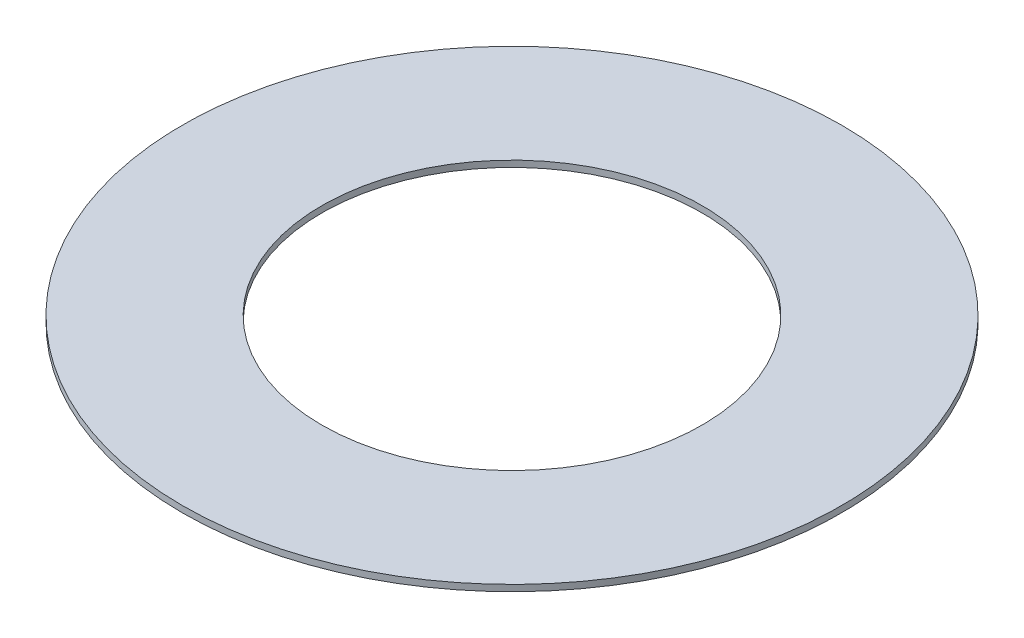
ISO-10303-21;
HEADER;
FILE_DESCRIPTION(('STEP AP214'),'2;1');
FILE_NAME('part.step','',(''),(''),'','','');
FILE_SCHEMA(('AUTOMOTIVE_DESIGN { 1 0 10303 214 1 1 1 1 }'));
ENDSEC;
DATA;
#1=APPLICATION_CONTEXT('core data for automotive mechanical design processes');
#2=APPLICATION_PROTOCOL_DEFINITION('international standard','automotive_design',2000,#1);
#3=PRODUCT_CONTEXT('',#1,'mechanical');
#4=PRODUCT('Part','Part','',(#3));
#5=PRODUCT_RELATED_PRODUCT_CATEGORY('part','',(#4));
#6=PRODUCT_DEFINITION_FORMATION('','',#4);
#7=PRODUCT_DEFINITION_CONTEXT('part definition',#1,'design');
#8=PRODUCT_DEFINITION('design','',#6,#7);
#9=PRODUCT_DEFINITION_SHAPE('','',#8);
#10=(LENGTH_UNIT() NAMED_UNIT(*) SI_UNIT(.MILLI.,.METRE.));
#11=(NAMED_UNIT(*) PLANE_ANGLE_UNIT() SI_UNIT($,.RADIAN.));
#12=(NAMED_UNIT(*) SI_UNIT($,.STERADIAN.) SOLID_ANGLE_UNIT());
#13=UNCERTAINTY_MEASURE_WITH_UNIT(LENGTH_MEASURE(1.E-05),#10,'distance_accuracy_value','');
#14=(GEOMETRIC_REPRESENTATION_CONTEXT(3) GLOBAL_UNCERTAINTY_ASSIGNED_CONTEXT((#13)) GLOBAL_UNIT_ASSIGNED_CONTEXT((#10,
#11,#12)) REPRESENTATION_CONTEXT('',''));
#15=CARTESIAN_POINT('',(0.,0.,0.));
#16=DIRECTION('',(0.,0.,1.));
#17=DIRECTION('',(1.,0.,0.));
#18=AXIS2_PLACEMENT_3D('',#15,#16,#17);
#19=CARTESIAN_POINT('',(0.,1.27,0.));
#20=DIRECTION('',(0.,1.,0.));
#21=DIRECTION('',(0.,0.,1.));
#22=AXIS2_PLACEMENT_3D('',#19,#20,#21);
#23=PLANE('',#22);
#24=CARTESIAN_POINT('',(0.,1.27,0.));
#25=DIRECTION('',(0.,1.,0.));
#26=DIRECTION('',(0.,0.,1.));
#27=AXIS2_PLACEMENT_3D('',#24,#25,#26);
#28=CIRCLE('',#27,66.04);
#29=CARTESIAN_POINT('',(0.,1.27,66.04));
#30=VERTEX_POINT('',#29);
#31=EDGE_CURVE('E10',#30,#30,#28,.T.);
#32=ORIENTED_EDGE('',*,*,#31,.T.);
#33=EDGE_LOOP('',(#32));
#34=FACE_BOUND('',#33,.T.);
#35=CARTESIAN_POINT('',(0.,1.27,0.));
#36=DIRECTION('',(0.,1.,0.));
#37=DIRECTION('',(0.,0.,1.));
#38=AXIS2_PLACEMENT_3D('',#35,#36,#37);
#39=CIRCLE('',#38,38.1);
#40=CARTESIAN_POINT('',(0.,1.27,38.1));
#41=VERTEX_POINT('',#40);
#42=EDGE_CURVE('E42',#41,#41,#39,.T.);
#43=ORIENTED_EDGE('',*,*,#42,.F.);
#44=EDGE_LOOP('',(#43));
#45=FACE_BOUND('',#44,.T.);
#46=ADVANCED_FACE('F31',(#34,#45),#23,.T.);
#47=CARTESIAN_POINT('',(0.,0.,0.));
#48=DIRECTION('',(0.,1.,0.));
#49=DIRECTION('',(0.,0.,1.));
#50=AXIS2_PLACEMENT_3D('',#47,#48,#49);
#51=PLANE('',#50);
#52=CARTESIAN_POINT('',(0.,0.,0.));
#53=DIRECTION('',(0.,1.,0.));
#54=DIRECTION('',(0.,0.,1.));
#55=AXIS2_PLACEMENT_3D('',#52,#53,#54);
#56=CIRCLE('',#55,66.04);
#57=CARTESIAN_POINT('',(0.,0.,66.04));
#58=VERTEX_POINT('',#57);
#59=EDGE_CURVE('E35',#58,#58,#56,.T.);
#60=ORIENTED_EDGE('',*,*,#59,.F.);
#61=EDGE_LOOP('',(#60));
#62=FACE_BOUND('',#61,.T.);
#63=CARTESIAN_POINT('',(0.,0.,0.));
#64=DIRECTION('',(0.,1.,0.));
#65=DIRECTION('',(0.,0.,1.));
#66=AXIS2_PLACEMENT_3D('',#63,#64,#65);
#67=CIRCLE('',#66,38.1);
#68=CARTESIAN_POINT('',(0.,0.,38.1));
#69=VERTEX_POINT('',#68);
#70=EDGE_CURVE('E44',#69,#69,#67,.T.);
#71=ORIENTED_EDGE('',*,*,#70,.T.);
#72=EDGE_LOOP('',(#71));
#73=FACE_BOUND('',#72,.T.);
#74=ADVANCED_FACE('F54',(#62,#73),#51,.F.);
#75=CARTESIAN_POINT('',(0.,1.27,0.));
#76=DIRECTION('',(0.,-1.,0.));
#77=DIRECTION('',(0.,0.,-1.));
#78=AXIS2_PLACEMENT_3D('',#75,#76,#77);
#79=CYLINDRICAL_SURFACE('',#78,66.04);
#80=ORIENTED_EDGE('',*,*,#31,.F.);
#81=EDGE_LOOP('',(#80));
#82=FACE_BOUND('',#81,.T.);
#83=ORIENTED_EDGE('',*,*,#59,.T.);
#84=EDGE_LOOP('',(#83));
#85=FACE_BOUND('',#84,.T.);
#86=ADVANCED_FACE('F33',(#82,#85),#79,.T.);
#87=CARTESIAN_POINT('',(0.,1.27,0.));
#88=DIRECTION('',(0.,-1.,0.));
#89=DIRECTION('',(0.,0.,-1.));
#90=AXIS2_PLACEMENT_3D('',#87,#88,#89);
#91=CYLINDRICAL_SURFACE('',#90,38.1);
#92=ORIENTED_EDGE('',*,*,#42,.T.);
#93=EDGE_LOOP('',(#92));
#94=FACE_BOUND('',#93,.T.);
#95=ORIENTED_EDGE('',*,*,#70,.F.);
#96=EDGE_LOOP('',(#95));
#97=FACE_BOUND('',#96,.T.);
#98=ADVANCED_FACE('F50',(#94,#97),#91,.F.);
#99=CLOSED_SHELL('',(#46,#74,#86,#98));
#100=MANIFOLD_SOLID_BREP('B2',#99);
#101=ADVANCED_BREP_SHAPE_REPRESENTATION('',(#18,#100),#14);
#102=SHAPE_DEFINITION_REPRESENTATION(#9,#101);
ENDSEC;
END-ISO-10303-21;
